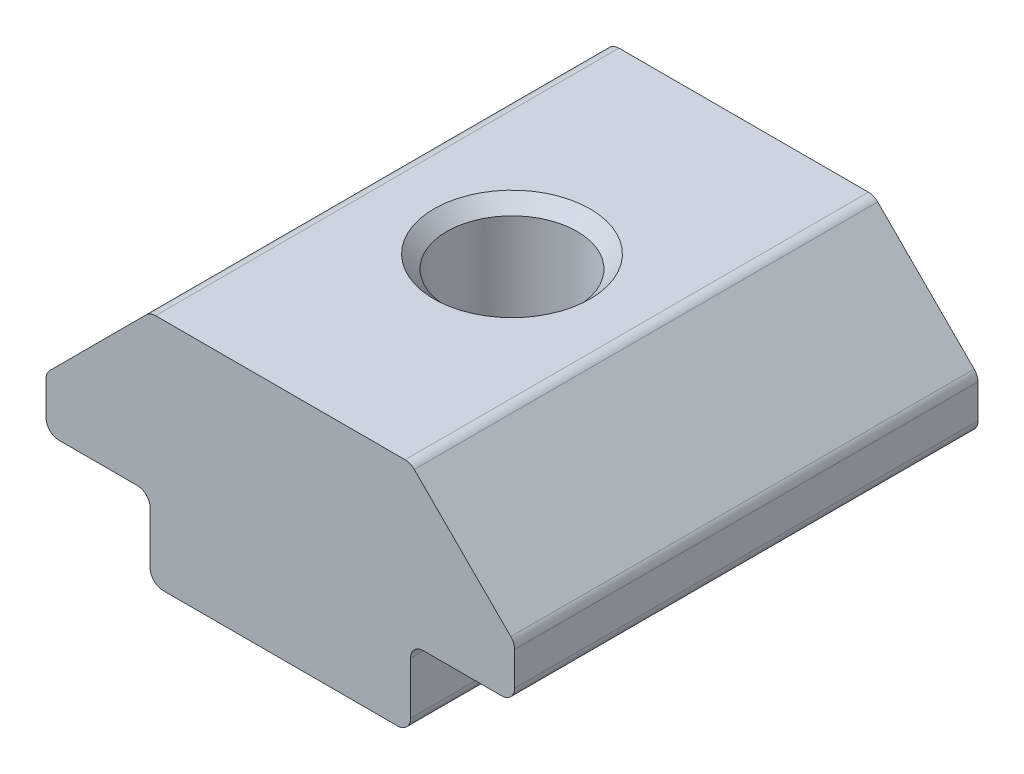
ISO-10303-21;
HEADER;
FILE_DESCRIPTION(('STEP AP214'),'2;1');
FILE_NAME('part.step','',(''),(''),'','','');
FILE_SCHEMA(('AUTOMOTIVE_DESIGN { 1 0 10303 214 1 1 1 1 }'));
ENDSEC;
DATA;
#1=APPLICATION_CONTEXT('core data for automotive mechanical design processes');
#2=APPLICATION_PROTOCOL_DEFINITION('international standard','automotive_design',2000,#1);
#3=PRODUCT_CONTEXT('',#1,'mechanical');
#4=PRODUCT('Part','Part','',(#3));
#5=PRODUCT_RELATED_PRODUCT_CATEGORY('part','',(#4));
#6=PRODUCT_DEFINITION_FORMATION('','',#4);
#7=PRODUCT_DEFINITION_CONTEXT('part definition',#1,'design');
#8=PRODUCT_DEFINITION('design','',#6,#7);
#9=PRODUCT_DEFINITION_SHAPE('','',#8);
#10=(LENGTH_UNIT() NAMED_UNIT(*) SI_UNIT(.MILLI.,.METRE.));
#11=(NAMED_UNIT(*) PLANE_ANGLE_UNIT() SI_UNIT($,.RADIAN.));
#12=(NAMED_UNIT(*) SI_UNIT($,.STERADIAN.) SOLID_ANGLE_UNIT());
#13=UNCERTAINTY_MEASURE_WITH_UNIT(LENGTH_MEASURE(1.E-05),#10,'distance_accuracy_value','');
#14=(GEOMETRIC_REPRESENTATION_CONTEXT(3) GLOBAL_UNCERTAINTY_ASSIGNED_CONTEXT((#13)) GLOBAL_UNIT_ASSIGNED_CONTEXT((#10,
#11,#12)) REPRESENTATION_CONTEXT('',''));
#15=CARTESIAN_POINT('',(0.,0.,0.));
#16=DIRECTION('',(0.,0.,1.));
#17=DIRECTION('',(1.,0.,0.));
#18=AXIS2_PLACEMENT_3D('',#15,#16,#17);
#19=CARTESIAN_POINT('',(-6.96668079058782,1.74958475249559,7.61762414375098));
#20=DIRECTION('',(1.,0.,0.));
#21=DIRECTION('',(0.,0.,-1.));
#22=AXIS2_PLACEMENT_3D('',#19,#20,#21);
#23=PLANE('',#22);
#24=DIRECTION('',(0.,-1.,0.));
#25=VECTOR('',#24,1.);
#26=CARTESIAN_POINT('',(-6.96668079058782,1.74958475249559,7.61762414375098));
#27=LINE('',#26,#25);
#28=CARTESIAN_POINT('',(-6.96668079058782,1.24958475249559,7.61762414375098));
#29=VERTEX_POINT('',#28);
#30=CARTESIAN_POINT('',(-6.96668079058782,-0.750415247504405,7.61762414375098));
#31=VERTEX_POINT('',#30);
#32=EDGE_CURVE('E204',#29,#31,#27,.T.);
#33=ORIENTED_EDGE('',*,*,#32,.F.);
#34=DIRECTION('',(0.,0.,-1.));
#35=VECTOR('',#34,1.);
#36=CARTESIAN_POINT('',(-6.96668079058782,1.24958475249559,-10.182375856249));
#37=LINE('',#36,#35);
#38=CARTESIAN_POINT('',(-6.96668079058782,1.24958475249559,-10.182375856249));
#39=VERTEX_POINT('',#38);
#40=EDGE_CURVE('E288',#29,#39,#37,.T.);
#41=ORIENTED_EDGE('',*,*,#40,.T.);
#42=DIRECTION('',(0.,-1.,0.));
#43=VECTOR('',#42,1.);
#44=CARTESIAN_POINT('',(-6.96668079058782,1.74958475249559,-10.182375856249));
#45=LINE('',#44,#43);
#46=CARTESIAN_POINT('',(-6.96668079058782,-0.750415247504405,-10.182375856249));
#47=VERTEX_POINT('',#46);
#48=EDGE_CURVE('E178',#39,#47,#45,.T.);
#49=ORIENTED_EDGE('',*,*,#48,.T.);
#50=DIRECTION('',(0.,0.,-1.));
#51=VECTOR('',#50,1.);
#52=CARTESIAN_POINT('',(-6.96668079058782,-0.750415247504405,7.61762414375098));
#53=LINE('',#52,#51);
#54=EDGE_CURVE('E160',#47,#31,#53,.F.);
#55=ORIENTED_EDGE('',*,*,#54,.T.);
#56=EDGE_LOOP('',(#33,#41,#49,#55));
#57=FACE_BOUND('',#56,.T.);
#58=ADVANCED_FACE('F16',(#57),#23,.F.);
#59=CARTESIAN_POINT('',(-6.96668079058782,-1.25041524750441,7.61762414375098));
#60=DIRECTION('',(0.,1.,0.));
#61=DIRECTION('',(0.,0.,1.));
#62=AXIS2_PLACEMENT_3D('',#59,#60,#61);
#63=PLANE('',#62);
#64=CARTESIAN_POINT('',(-1.96668079058781,-1.25041524750441,-1.28237585624902));
#65=DIRECTION('',(0.,1.,0.));
#66=DIRECTION('',(0.,0.,1.));
#67=AXIS2_PLACEMENT_3D('',#64,#65,#66);
#68=CIRCLE('',#67,3.);
#69=CARTESIAN_POINT('',(-1.96668079058781,-1.25041524750441,1.71762414375098));
#70=VERTEX_POINT('',#69);
#71=EDGE_CURVE('E271',#70,#70,#68,.T.);
#72=ORIENTED_EDGE('',*,*,#71,.T.);
#73=EDGE_LOOP('',(#72));
#74=FACE_BOUND('',#73,.T.);
#75=DIRECTION('',(1.,0.,0.));
#76=VECTOR('',#75,1.);
#77=CARTESIAN_POINT('',(-6.96668079058782,-1.25041524750441,7.61762414375098));
#78=LINE('',#77,#76);
#79=CARTESIAN_POINT('',(-6.46668079058782,-1.25041524750441,7.61762414375098));
#80=VERTEX_POINT('',#79);
#81=CARTESIAN_POINT('',(2.53331920941219,-1.25041524750441,7.61762414375098));
#82=VERTEX_POINT('',#81);
#83=EDGE_CURVE('E171',#80,#82,#78,.T.);
#84=ORIENTED_EDGE('',*,*,#83,.F.);
#85=DIRECTION('',(0.,0.,-1.));
#86=VECTOR('',#85,1.);
#87=CARTESIAN_POINT('',(-6.46668079058782,-1.25041524750441,7.61762414375098));
#88=LINE('',#87,#86);
#89=CARTESIAN_POINT('',(-6.46668079058782,-1.25041524750441,-10.182375856249));
#90=VERTEX_POINT('',#89);
#91=EDGE_CURVE('E158',#80,#90,#88,.T.);
#92=ORIENTED_EDGE('',*,*,#91,.T.);
#93=DIRECTION('',(1.,0.,0.));
#94=VECTOR('',#93,1.);
#95=CARTESIAN_POINT('',(-6.96668079058782,-1.25041524750441,-10.182375856249));
#96=LINE('',#95,#94);
#97=CARTESIAN_POINT('',(2.53331920941219,-1.25041524750441,-10.182375856249));
#98=VERTEX_POINT('',#97);
#99=EDGE_CURVE('E168',#90,#98,#96,.T.);
#100=ORIENTED_EDGE('',*,*,#99,.T.);
#101=DIRECTION('',(0.,0.,-1.));
#102=VECTOR('',#101,1.);
#103=CARTESIAN_POINT('',(2.53331920941219,-1.25041524750441,7.61762414375098));
#104=LINE('',#103,#102);
#105=EDGE_CURVE('E173',#98,#82,#104,.F.);
#106=ORIENTED_EDGE('',*,*,#105,.T.);
#107=EDGE_LOOP('',(#84,#92,#100,#106));
#108=FACE_BOUND('',#107,.T.);
#109=ADVANCED_FACE('F167',(#74,#108),#63,.F.);
#110=CARTESIAN_POINT('',(3.03331920941218,-1.25041524750441,7.61762414375098));
#111=DIRECTION('',(-1.,0.,0.));
#112=DIRECTION('',(0.,0.,1.));
#113=AXIS2_PLACEMENT_3D('',#110,#111,#112);
#114=PLANE('',#113);
#115=DIRECTION('',(0.,1.,0.));
#116=VECTOR('',#115,1.);
#117=CARTESIAN_POINT('',(3.03331920941218,-1.25041524750441,-10.182375856249));
#118=LINE('',#117,#116);
#119=CARTESIAN_POINT('',(3.03331920941218,-0.750415247504405,-10.182375856249));
#120=VERTEX_POINT('',#119);
#121=CARTESIAN_POINT('',(3.03331920941218,1.24958475249559,-10.182375856249));
#122=VERTEX_POINT('',#121);
#123=EDGE_CURVE('E177',#120,#122,#118,.T.);
#124=ORIENTED_EDGE('',*,*,#123,.T.);
#125=DIRECTION('',(0.,0.,-1.));
#126=VECTOR('',#125,1.);
#127=CARTESIAN_POINT('',(3.03331920941218,1.24958475249559,7.61762414375098));
#128=LINE('',#127,#126);
#129=CARTESIAN_POINT('',(3.03331920941218,1.24958475249559,7.61762414375098));
#130=VERTEX_POINT('',#129);
#131=EDGE_CURVE('E286',#122,#130,#128,.F.);
#132=ORIENTED_EDGE('',*,*,#131,.T.);
#133=DIRECTION('',(0.,1.,0.));
#134=VECTOR('',#133,1.);
#135=CARTESIAN_POINT('',(3.03331920941218,-1.25041524750441,7.61762414375098));
#136=LINE('',#135,#134);
#137=CARTESIAN_POINT('',(3.03331920941218,-0.750415247504405,7.61762414375098));
#138=VERTEX_POINT('',#137);
#139=EDGE_CURVE('E302',#138,#130,#136,.T.);
#140=ORIENTED_EDGE('',*,*,#139,.F.);
#141=DIRECTION('',(0.,0.,-1.));
#142=VECTOR('',#141,1.);
#143=CARTESIAN_POINT('',(3.03331920941218,-0.750415247504405,7.61762414375098));
#144=LINE('',#143,#142);
#145=EDGE_CURVE('E268',#138,#120,#144,.T.);
#146=ORIENTED_EDGE('',*,*,#145,.T.);
#147=EDGE_LOOP('',(#124,#132,#140,#146));
#148=FACE_BOUND('',#147,.T.);
#149=ADVANCED_FACE('F315',(#148),#114,.F.);
#150=CARTESIAN_POINT('',(3.03331920941218,1.74958475249559,7.61762414375098));
#151=DIRECTION('',(0.,1.,0.));
#152=DIRECTION('',(0.,0.,1.));
#153=AXIS2_PLACEMENT_3D('',#150,#151,#152);
#154=PLANE('',#153);
#155=DIRECTION('',(1.,0.,0.));
#156=VECTOR('',#155,1.);
#157=CARTESIAN_POINT('',(3.03331920941218,1.74958475249559,7.61762414375098));
#158=LINE('',#157,#156);
#159=CARTESIAN_POINT('',(3.53331920941218,1.74958475249559,7.61762414375098));
#160=VERTEX_POINT('',#159);
#161=CARTESIAN_POINT('',(6.53331920941218,1.74958475249559,7.61762414375098));
#162=VERTEX_POINT('',#161);
#163=EDGE_CURVE('E300',#160,#162,#158,.T.);
#164=ORIENTED_EDGE('',*,*,#163,.F.);
#165=DIRECTION('',(0.,0.,-1.));
#166=VECTOR('',#165,1.);
#167=CARTESIAN_POINT('',(3.53331920941218,1.74958475249559,-10.182375856249));
#168=LINE('',#167,#166);
#169=CARTESIAN_POINT('',(3.53331920941218,1.74958475249559,-10.182375856249));
#170=VERTEX_POINT('',#169);
#171=EDGE_CURVE('E283',#160,#170,#168,.T.);
#172=ORIENTED_EDGE('',*,*,#171,.T.);
#173=DIRECTION('',(1.,0.,0.));
#174=VECTOR('',#173,1.);
#175=CARTESIAN_POINT('',(3.03331920941218,1.74958475249559,-10.182375856249));
#176=LINE('',#175,#174);
#177=CARTESIAN_POINT('',(6.53331920941218,1.74958475249559,-10.182375856249));
#178=VERTEX_POINT('',#177);
#179=EDGE_CURVE('E181',#170,#178,#176,.T.);
#180=ORIENTED_EDGE('',*,*,#179,.T.);
#181=DIRECTION('',(0.,0.,-1.));
#182=VECTOR('',#181,1.);
#183=CARTESIAN_POINT('',(6.53331920941218,1.74958475249559,7.61762414375098));
#184=LINE('',#183,#182);
#185=EDGE_CURVE('E265',#178,#162,#184,.F.);
#186=ORIENTED_EDGE('',*,*,#185,.T.);
#187=EDGE_LOOP('',(#164,#172,#180,#186));
#188=FACE_BOUND('',#187,.T.);
#189=ADVANCED_FACE('F307',(#188),#154,.F.);
#190=CARTESIAN_POINT('',(7.03331920941218,1.74958475249559,7.61762414375098));
#191=DIRECTION('',(-1.,0.,0.));
#192=DIRECTION('',(0.,0.,1.));
#193=AXIS2_PLACEMENT_3D('',#190,#191,#192);
#194=PLANE('',#193);
#195=DIRECTION('',(0.,1.,0.));
#196=VECTOR('',#195,1.);
#197=CARTESIAN_POINT('',(7.03331920941218,1.74958475249559,-10.182375856249));
#198=LINE('',#197,#196);
#199=CARTESIAN_POINT('',(7.03331920941218,2.24958475249559,-10.182375856249));
#200=VERTEX_POINT('',#199);
#201=CARTESIAN_POINT('',(7.03331920941218,3.54247797130906,-10.182375856249));
#202=VERTEX_POINT('',#201);
#203=EDGE_CURVE('E187',#200,#202,#198,.T.);
#204=ORIENTED_EDGE('',*,*,#203,.T.);
#205=DIRECTION('',(0.,0.,-1.));
#206=VECTOR('',#205,1.);
#207=CARTESIAN_POINT('',(7.03331920941218,3.54247797130906,7.61762414375098));
#208=LINE('',#207,#206);
#209=CARTESIAN_POINT('',(7.03331920941218,3.54247797130906,7.61762414375098));
#210=VERTEX_POINT('',#209);
#211=EDGE_CURVE('E263',#202,#210,#208,.F.);
#212=ORIENTED_EDGE('',*,*,#211,.T.);
#213=DIRECTION('',(0.,1.,0.));
#214=VECTOR('',#213,1.);
#215=CARTESIAN_POINT('',(7.03331920941218,1.74958475249559,7.61762414375098));
#216=LINE('',#215,#214);
#217=CARTESIAN_POINT('',(7.03331920941218,2.24958475249559,7.61762414375098));
#218=VERTEX_POINT('',#217);
#219=EDGE_CURVE('E311',#218,#210,#216,.T.);
#220=ORIENTED_EDGE('',*,*,#219,.F.);
#221=DIRECTION('',(0.,0.,-1.));
#222=VECTOR('',#221,1.);
#223=CARTESIAN_POINT('',(7.03331920941218,2.24958475249559,7.61762414375098));
#224=LINE('',#223,#222);
#225=EDGE_CURVE('E260',#218,#200,#224,.T.);
#226=ORIENTED_EDGE('',*,*,#225,.T.);
#227=EDGE_LOOP('',(#204,#212,#220,#226));
#228=FACE_BOUND('',#227,.T.);
#229=ADVANCED_FACE('F541',(#228),#194,.F.);
#230=CARTESIAN_POINT('',(7.03331920941218,3.74958475249561,7.61762414375098));
#231=DIRECTION('',(-0.707106781186546,-0.707106781186549,0.));
#232=DIRECTION('',(0.707106781186549,-0.707106781186546,0.));
#233=AXIS2_PLACEMENT_3D('',#230,#231,#232);
#234=PLANE('',#233);
#235=DIRECTION('',(-0.707106781186549,0.707106781186546,0.));
#236=VECTOR('',#235,1.);
#237=CARTESIAN_POINT('',(7.03331920941218,3.74958475249561,-10.182375856249));
#238=LINE('',#237,#236);
#239=CARTESIAN_POINT('',(6.88687260000546,3.89603136190234,-10.182375856249));
#240=VERTEX_POINT('',#239);
#241=CARTESIAN_POINT('',(3.17976581881891,7.60313814308887,-10.182375856249));
#242=VERTEX_POINT('',#241);
#243=EDGE_CURVE('E190',#240,#242,#238,.T.);
#244=ORIENTED_EDGE('',*,*,#243,.T.);
#245=DIRECTION('',(0.,0.,-1.));
#246=VECTOR('',#245,1.);
#247=CARTESIAN_POINT('',(3.17976581881891,7.60313814308887,7.61762414375098));
#248=LINE('',#247,#246);
#249=CARTESIAN_POINT('',(3.17976581881891,7.60313814308887,7.61762414375098));
#250=VERTEX_POINT('',#249);
#251=EDGE_CURVE('E258',#242,#250,#248,.F.);
#252=ORIENTED_EDGE('',*,*,#251,.T.);
#253=DIRECTION('',(-0.707106781186549,0.707106781186546,0.));
#254=VECTOR('',#253,1.);
#255=CARTESIAN_POINT('',(7.03331920941218,3.74958475249561,7.61762414375098));
#256=LINE('',#255,#254);
#257=CARTESIAN_POINT('',(6.88687260000546,3.89603136190234,7.61762414375098));
#258=VERTEX_POINT('',#257);
#259=EDGE_CURVE('E326',#258,#250,#256,.T.);
#260=ORIENTED_EDGE('',*,*,#259,.F.);
#261=DIRECTION('',(0.,0.,-1.));
#262=VECTOR('',#261,1.);
#263=CARTESIAN_POINT('',(6.88687260000546,3.89603136190234,7.61762414375098));
#264=LINE('',#263,#262);
#265=EDGE_CURVE('E255',#258,#240,#264,.T.);
#266=ORIENTED_EDGE('',*,*,#265,.T.);
#267=EDGE_LOOP('',(#244,#252,#260,#266));
#268=FACE_BOUND('',#267,.T.);
#269=ADVANCED_FACE('F531',(#268),#234,.F.);
#270=CARTESIAN_POINT('',(3.03331920941218,7.74958475249559,7.61762414375098));
#271=DIRECTION('',(0.,-1.,0.));
#272=DIRECTION('',(0.,0.,-1.));
#273=AXIS2_PLACEMENT_3D('',#270,#271,#272);
#274=PLANE('',#273);
#275=CARTESIAN_POINT('',(-1.96668079058781,7.74958475249559,-1.28237585624902));
#276=DIRECTION('',(0.,-1.,0.));
#277=DIRECTION('',(0.,0.,-1.));
#278=AXIS2_PLACEMENT_3D('',#275,#276,#277);
#279=CIRCLE('',#278,3.00000000000001);
#280=CARTESIAN_POINT('',(-1.96668079058781,7.74958475249559,-4.28237585624902));
#281=VERTEX_POINT('',#280);
#282=EDGE_CURVE('E280',#281,#281,#279,.T.);
#283=ORIENTED_EDGE('',*,*,#282,.T.);
#284=EDGE_LOOP('',(#283));
#285=FACE_BOUND('',#284,.T.);
#286=DIRECTION('',(-1.,0.,0.));
#287=VECTOR('',#286,1.);
#288=CARTESIAN_POINT('',(3.03331920941218,7.74958475249559,-10.182375856249));
#289=LINE('',#288,#287);
#290=CARTESIAN_POINT('',(2.82621242822564,7.74958475249559,-10.182375856249));
#291=VERTEX_POINT('',#290);
#292=CARTESIAN_POINT('',(-6.75957400940127,7.74958475249559,-10.182375856249));
#293=VERTEX_POINT('',#292);
#294=EDGE_CURVE('E193',#291,#293,#289,.T.);
#295=ORIENTED_EDGE('',*,*,#294,.T.);
#296=DIRECTION('',(0.,0.,-1.));
#297=VECTOR('',#296,1.);
#298=CARTESIAN_POINT('',(-6.75957400940127,7.74958475249559,7.61762414375098));
#299=LINE('',#298,#297);
#300=CARTESIAN_POINT('',(-6.75957400940127,7.74958475249559,7.61762414375098));
#301=VERTEX_POINT('',#300);
#302=EDGE_CURVE('E253',#293,#301,#299,.F.);
#303=ORIENTED_EDGE('',*,*,#302,.T.);
#304=DIRECTION('',(-1.,0.,0.));
#305=VECTOR('',#304,1.);
#306=CARTESIAN_POINT('',(3.03331920941218,7.74958475249559,7.61762414375098));
#307=LINE('',#306,#305);
#308=CARTESIAN_POINT('',(2.82621242822564,7.74958475249559,7.61762414375098));
#309=VERTEX_POINT('',#308);
#310=EDGE_CURVE('E329',#309,#301,#307,.T.);
#311=ORIENTED_EDGE('',*,*,#310,.F.);
#312=DIRECTION('',(0.,0.,-1.));
#313=VECTOR('',#312,1.);
#314=CARTESIAN_POINT('',(2.82621242822564,7.74958475249559,7.61762414375098));
#315=LINE('',#314,#313);
#316=EDGE_CURVE('E250',#309,#291,#315,.T.);
#317=ORIENTED_EDGE('',*,*,#316,.T.);
#318=EDGE_LOOP('',(#295,#303,#311,#317));
#319=FACE_BOUND('',#318,.T.);
#320=ADVANCED_FACE('F521',(#285,#319),#274,.F.);
#321=CARTESIAN_POINT('',(-10.9666807905878,3.74958475249561,7.61762414375098));
#322=DIRECTION('',(0.707106781186546,-0.707106781186549,0.));
#323=DIRECTION('',(0.707106781186549,0.707106781186546,0.));
#324=AXIS2_PLACEMENT_3D('',#321,#322,#323);
#325=PLANE('',#324);
#326=DIRECTION('',(-0.707106781186549,-0.707106781186546,0.));
#327=VECTOR('',#326,1.);
#328=CARTESIAN_POINT('',(-10.9666807905878,3.74958475249561,-10.182375856249));
#329=LINE('',#328,#327);
#330=CARTESIAN_POINT('',(-7.11312739999454,7.60313814308887,-10.182375856249));
#331=VERTEX_POINT('',#330);
#332=CARTESIAN_POINT('',(-10.8202341811811,3.89603136190233,-10.182375856249));
#333=VERTEX_POINT('',#332);
#334=EDGE_CURVE('E196',#331,#333,#329,.T.);
#335=ORIENTED_EDGE('',*,*,#334,.T.);
#336=DIRECTION('',(0.,0.,-1.));
#337=VECTOR('',#336,1.);
#338=CARTESIAN_POINT('',(-10.8202341811811,3.89603136190233,7.61762414375098));
#339=LINE('',#338,#337);
#340=CARTESIAN_POINT('',(-10.8202341811811,3.89603136190233,7.61762414375098));
#341=VERTEX_POINT('',#340);
#342=EDGE_CURVE('E248',#333,#341,#339,.F.);
#343=ORIENTED_EDGE('',*,*,#342,.T.);
#344=DIRECTION('',(-0.707106781186549,-0.707106781186546,0.));
#345=VECTOR('',#344,1.);
#346=CARTESIAN_POINT('',(-10.9666807905878,3.74958475249561,7.61762414375098));
#347=LINE('',#346,#345);
#348=CARTESIAN_POINT('',(-7.11312739999454,7.60313814308887,7.61762414375098));
#349=VERTEX_POINT('',#348);
#350=EDGE_CURVE('E332',#349,#341,#347,.T.);
#351=ORIENTED_EDGE('',*,*,#350,.F.);
#352=DIRECTION('',(0.,0.,-1.));
#353=VECTOR('',#352,1.);
#354=CARTESIAN_POINT('',(-7.11312739999454,7.60313814308887,7.61762414375098));
#355=LINE('',#354,#353);
#356=EDGE_CURVE('E245',#349,#331,#355,.T.);
#357=ORIENTED_EDGE('',*,*,#356,.T.);
#358=EDGE_LOOP('',(#335,#343,#351,#357));
#359=FACE_BOUND('',#358,.T.);
#360=ADVANCED_FACE('F511',(#359),#325,.F.);
#361=CARTESIAN_POINT('',(-10.9666807905878,1.74958475249559,7.61762414375098));
#362=DIRECTION('',(1.,0.,0.));
#363=DIRECTION('',(0.,0.,-1.));
#364=AXIS2_PLACEMENT_3D('',#361,#362,#363);
#365=PLANE('',#364);
#366=DIRECTION('',(0.,-1.,0.));
#367=VECTOR('',#366,1.);
#368=CARTESIAN_POINT('',(-10.9666807905878,1.74958475249559,-10.182375856249));
#369=LINE('',#368,#367);
#370=CARTESIAN_POINT('',(-10.9666807905878,3.54247797130906,-10.182375856249));
#371=VERTEX_POINT('',#370);
#372=CARTESIAN_POINT('',(-10.9666807905878,2.24958475249559,-10.182375856249));
#373=VERTEX_POINT('',#372);
#374=EDGE_CURVE('E199',#371,#373,#369,.T.);
#375=ORIENTED_EDGE('',*,*,#374,.T.);
#376=DIRECTION('',(0.,0.,-1.));
#377=VECTOR('',#376,1.);
#378=CARTESIAN_POINT('',(-10.9666807905878,2.24958475249559,7.61762414375098));
#379=LINE('',#378,#377);
#380=CARTESIAN_POINT('',(-10.9666807905878,2.24958475249559,7.61762414375098));
#381=VERTEX_POINT('',#380);
#382=EDGE_CURVE('E243',#373,#381,#379,.F.);
#383=ORIENTED_EDGE('',*,*,#382,.T.);
#384=DIRECTION('',(0.,-1.,0.));
#385=VECTOR('',#384,1.);
#386=CARTESIAN_POINT('',(-10.9666807905878,1.74958475249559,7.61762414375098));
#387=LINE('',#386,#385);
#388=CARTESIAN_POINT('',(-10.9666807905878,3.54247797130906,7.61762414375098));
#389=VERTEX_POINT('',#388);
#390=EDGE_CURVE('E335',#389,#381,#387,.T.);
#391=ORIENTED_EDGE('',*,*,#390,.F.);
#392=DIRECTION('',(0.,0.,-1.));
#393=VECTOR('',#392,1.);
#394=CARTESIAN_POINT('',(-10.9666807905878,3.54247797130906,7.61762414375098));
#395=LINE('',#394,#393);
#396=EDGE_CURVE('E240',#389,#371,#395,.T.);
#397=ORIENTED_EDGE('',*,*,#396,.T.);
#398=EDGE_LOOP('',(#375,#383,#391,#397));
#399=FACE_BOUND('',#398,.T.);
#400=ADVANCED_FACE('F502',(#399),#365,.F.);
#401=CARTESIAN_POINT('',(-10.9666807905878,1.74958475249559,7.61762414375098));
#402=DIRECTION('',(0.,1.,0.));
#403=DIRECTION('',(0.,0.,1.));
#404=AXIS2_PLACEMENT_3D('',#401,#402,#403);
#405=PLANE('',#404);
#406=DIRECTION('',(1.,0.,0.));
#407=VECTOR('',#406,1.);
#408=CARTESIAN_POINT('',(-10.9666807905878,1.74958475249559,-10.182375856249));
#409=LINE('',#408,#407);
#410=CARTESIAN_POINT('',(-10.4666807905878,1.74958475249559,-10.182375856249));
#411=VERTEX_POINT('',#410);
#412=CARTESIAN_POINT('',(-7.46668079058782,1.74958475249559,-10.182375856249));
#413=VERTEX_POINT('',#412);
#414=EDGE_CURVE('E202',#411,#413,#409,.T.);
#415=ORIENTED_EDGE('',*,*,#414,.T.);
#416=DIRECTION('',(0.,0.,-1.));
#417=VECTOR('',#416,1.);
#418=CARTESIAN_POINT('',(-7.46668079058782,1.74958475249559,7.61762414375098));
#419=LINE('',#418,#417);
#420=CARTESIAN_POINT('',(-7.46668079058782,1.74958475249559,7.61762414375098));
#421=VERTEX_POINT('',#420);
#422=EDGE_CURVE('E37',#413,#421,#419,.F.);
#423=ORIENTED_EDGE('',*,*,#422,.T.);
#424=DIRECTION('',(1.,0.,0.));
#425=VECTOR('',#424,1.);
#426=CARTESIAN_POINT('',(-10.9666807905878,1.74958475249559,7.61762414375098));
#427=LINE('',#426,#425);
#428=CARTESIAN_POINT('',(-10.4666807905878,1.74958475249559,7.61762414375098));
#429=VERTEX_POINT('',#428);
#430=EDGE_CURVE('E205',#429,#421,#427,.T.);
#431=ORIENTED_EDGE('',*,*,#430,.F.);
#432=DIRECTION('',(0.,0.,-1.));
#433=VECTOR('',#432,1.);
#434=CARTESIAN_POINT('',(-10.4666807905878,1.74958475249559,7.61762414375098));
#435=LINE('',#434,#433);
#436=EDGE_CURVE('E237',#429,#411,#435,.T.);
#437=ORIENTED_EDGE('',*,*,#436,.T.);
#438=EDGE_LOOP('',(#415,#423,#431,#437));
#439=FACE_BOUND('',#438,.T.);
#440=ADVANCED_FACE('F493',(#439),#405,.F.);
#441=CARTESIAN_POINT('',(-1.96668079058782,-1.25041524750441,7.61762414375098));
#442=DIRECTION('',(0.,0.,1.));
#443=DIRECTION('',(1.,0.,0.));
#444=AXIS2_PLACEMENT_3D('',#441,#442,#443);
#445=PLANE('',#444);
#446=ORIENTED_EDGE('',*,*,#430,.T.);
#447=CARTESIAN_POINT('',(-7.46668079058782,1.24958475249559,7.61762414375098));
#448=DIRECTION('',(0.,0.,1.));
#449=DIRECTION('',(1.,0.,0.));
#450=AXIS2_PLACEMENT_3D('',#447,#448,#449);
#451=CIRCLE('',#450,0.5);
#452=EDGE_CURVE('E10',#421,#29,#451,.F.);
#453=ORIENTED_EDGE('',*,*,#452,.T.);
#454=ORIENTED_EDGE('',*,*,#32,.T.);
#455=CARTESIAN_POINT('',(-6.46668079058782,-0.750415247504405,7.61762414375098));
#456=DIRECTION('',(0.,0.,1.));
#457=DIRECTION('',(1.,0.,0.));
#458=AXIS2_PLACEMENT_3D('',#455,#456,#457);
#459=CIRCLE('',#458,0.5);
#460=EDGE_CURVE('E235',#31,#80,#459,.T.);
#461=ORIENTED_EDGE('',*,*,#460,.T.);
#462=ORIENTED_EDGE('',*,*,#83,.T.);
#463=CARTESIAN_POINT('',(2.53331920941218,-0.750415247504405,7.61762414375098));
#464=DIRECTION('',(0.,0.,1.));
#465=DIRECTION('',(1.,0.,0.));
#466=AXIS2_PLACEMENT_3D('',#463,#464,#465);
#467=CIRCLE('',#466,0.5);
#468=EDGE_CURVE('E221',#82,#138,#467,.T.);
#469=ORIENTED_EDGE('',*,*,#468,.T.);
#470=ORIENTED_EDGE('',*,*,#139,.T.);
#471=CARTESIAN_POINT('',(3.53331920941218,1.24958475249559,7.61762414375098));
#472=DIRECTION('',(0.,0.,1.));
#473=DIRECTION('',(1.,0.,0.));
#474=AXIS2_PLACEMENT_3D('',#471,#472,#473);
#475=CIRCLE('',#474,0.5);
#476=EDGE_CURVE('E294',#130,#160,#475,.F.);
#477=ORIENTED_EDGE('',*,*,#476,.T.);
#478=ORIENTED_EDGE('',*,*,#163,.T.);
#479=CARTESIAN_POINT('',(6.53331920941218,2.24958475249559,7.61762414375098));
#480=DIRECTION('',(0.,0.,1.));
#481=DIRECTION('',(1.,0.,0.));
#482=AXIS2_PLACEMENT_3D('',#479,#480,#481);
#483=CIRCLE('',#482,0.5);
#484=EDGE_CURVE('E223',#162,#218,#483,.T.);
#485=ORIENTED_EDGE('',*,*,#484,.T.);
#486=ORIENTED_EDGE('',*,*,#219,.T.);
#487=CARTESIAN_POINT('',(6.53331920941218,3.54247797130906,7.61762414375098));
#488=DIRECTION('',(0.,0.,1.));
#489=DIRECTION('',(1.,0.,0.));
#490=AXIS2_PLACEMENT_3D('',#487,#488,#489);
#491=CIRCLE('',#490,0.5);
#492=EDGE_CURVE('E225',#210,#258,#491,.T.);
#493=ORIENTED_EDGE('',*,*,#492,.T.);
#494=ORIENTED_EDGE('',*,*,#259,.T.);
#495=CARTESIAN_POINT('',(2.82621242822564,7.24958475249559,7.61762414375098));
#496=DIRECTION('',(0.,0.,1.));
#497=DIRECTION('',(1.,0.,0.));
#498=AXIS2_PLACEMENT_3D('',#495,#496,#497);
#499=CIRCLE('',#498,0.5);
#500=EDGE_CURVE('E227',#250,#309,#499,.T.);
#501=ORIENTED_EDGE('',*,*,#500,.T.);
#502=ORIENTED_EDGE('',*,*,#310,.T.);
#503=CARTESIAN_POINT('',(-6.75957400940127,7.24958475249559,7.61762414375098));
#504=DIRECTION('',(0.,0.,1.));
#505=DIRECTION('',(1.,0.,0.));
#506=AXIS2_PLACEMENT_3D('',#503,#504,#505);
#507=CIRCLE('',#506,0.5);
#508=EDGE_CURVE('E229',#301,#349,#507,.T.);
#509=ORIENTED_EDGE('',*,*,#508,.T.);
#510=ORIENTED_EDGE('',*,*,#350,.T.);
#511=CARTESIAN_POINT('',(-10.4666807905878,3.54247797130906,7.61762414375098));
#512=DIRECTION('',(0.,0.,1.));
#513=DIRECTION('',(1.,0.,0.));
#514=AXIS2_PLACEMENT_3D('',#511,#512,#513);
#515=CIRCLE('',#514,0.5);
#516=EDGE_CURVE('E231',#341,#389,#515,.T.);
#517=ORIENTED_EDGE('',*,*,#516,.T.);
#518=ORIENTED_EDGE('',*,*,#390,.T.);
#519=CARTESIAN_POINT('',(-10.4666807905878,2.24958475249559,7.61762414375098));
#520=DIRECTION('',(0.,0.,1.));
#521=DIRECTION('',(1.,0.,0.));
#522=AXIS2_PLACEMENT_3D('',#519,#520,#521);
#523=CIRCLE('',#522,0.5);
#524=EDGE_CURVE('E233',#381,#429,#523,.T.);
#525=ORIENTED_EDGE('',*,*,#524,.T.);
#526=EDGE_LOOP('',(#446,#453,#454,#461,#462,#469,#470,#477,#478,#485,#486,#493,#494,#501,#502,
#509,#510,#517,#518,#525));
#527=FACE_BOUND('',#526,.T.);
#528=ADVANCED_FACE('F299',(#527),#445,.T.);
#529=CARTESIAN_POINT('',(-1.96668079058782,-1.25041524750441,-10.182375856249));
#530=DIRECTION('',(0.,0.,1.));
#531=DIRECTION('',(1.,0.,0.));
#532=AXIS2_PLACEMENT_3D('',#529,#530,#531);
#533=PLANE('',#532);
#534=ORIENTED_EDGE('',*,*,#99,.F.);
#535=CARTESIAN_POINT('',(-6.46668079058782,-0.750415247504405,-10.182375856249));
#536=DIRECTION('',(0.,0.,1.));
#537=DIRECTION('',(1.,0.,0.));
#538=AXIS2_PLACEMENT_3D('',#535,#536,#537);
#539=CIRCLE('',#538,0.5);
#540=EDGE_CURVE('E154',#90,#47,#539,.F.);
#541=ORIENTED_EDGE('',*,*,#540,.T.);
#542=ORIENTED_EDGE('',*,*,#48,.F.);
#543=CARTESIAN_POINT('',(-7.46668079058782,1.24958475249559,-10.182375856249));
#544=DIRECTION('',(0.,0.,1.));
#545=DIRECTION('',(1.,0.,0.));
#546=AXIS2_PLACEMENT_3D('',#543,#544,#545);
#547=CIRCLE('',#546,0.5);
#548=EDGE_CURVE('E24',#39,#413,#547,.T.);
#549=ORIENTED_EDGE('',*,*,#548,.T.);
#550=ORIENTED_EDGE('',*,*,#414,.F.);
#551=CARTESIAN_POINT('',(-10.4666807905878,2.24958475249559,-10.182375856249));
#552=DIRECTION('',(0.,0.,1.));
#553=DIRECTION('',(1.,0.,0.));
#554=AXIS2_PLACEMENT_3D('',#551,#552,#553);
#555=CIRCLE('',#554,0.5);
#556=EDGE_CURVE('E162',#411,#373,#555,.F.);
#557=ORIENTED_EDGE('',*,*,#556,.T.);
#558=ORIENTED_EDGE('',*,*,#374,.F.);
#559=CARTESIAN_POINT('',(-10.4666807905878,3.54247797130906,-10.182375856249));
#560=DIRECTION('',(0.,0.,1.));
#561=DIRECTION('',(1.,0.,0.));
#562=AXIS2_PLACEMENT_3D('',#559,#560,#561);
#563=CIRCLE('',#562,0.5);
#564=EDGE_CURVE('E217',#371,#333,#563,.F.);
#565=ORIENTED_EDGE('',*,*,#564,.T.);
#566=ORIENTED_EDGE('',*,*,#334,.F.);
#567=CARTESIAN_POINT('',(-6.75957400940127,7.24958475249559,-10.182375856249));
#568=DIRECTION('',(0.,0.,1.));
#569=DIRECTION('',(1.,0.,0.));
#570=AXIS2_PLACEMENT_3D('',#567,#568,#569);
#571=CIRCLE('',#570,0.5);
#572=EDGE_CURVE('E215',#331,#293,#571,.F.);
#573=ORIENTED_EDGE('',*,*,#572,.T.);
#574=ORIENTED_EDGE('',*,*,#294,.F.);
#575=CARTESIAN_POINT('',(2.82621242822564,7.24958475249559,-10.182375856249));
#576=DIRECTION('',(0.,0.,1.));
#577=DIRECTION('',(1.,0.,0.));
#578=AXIS2_PLACEMENT_3D('',#575,#576,#577);
#579=CIRCLE('',#578,0.5);
#580=EDGE_CURVE('E213',#291,#242,#579,.F.);
#581=ORIENTED_EDGE('',*,*,#580,.T.);
#582=ORIENTED_EDGE('',*,*,#243,.F.);
#583=CARTESIAN_POINT('',(6.53331920941218,3.54247797130906,-10.182375856249));
#584=DIRECTION('',(0.,0.,1.));
#585=DIRECTION('',(1.,0.,0.));
#586=AXIS2_PLACEMENT_3D('',#583,#584,#585);
#587=CIRCLE('',#586,0.5);
#588=EDGE_CURVE('E211',#240,#202,#587,.F.);
#589=ORIENTED_EDGE('',*,*,#588,.T.);
#590=ORIENTED_EDGE('',*,*,#203,.F.);
#591=CARTESIAN_POINT('',(6.53331920941218,2.24958475249559,-10.182375856249));
#592=DIRECTION('',(0.,0.,1.));
#593=DIRECTION('',(1.,0.,0.));
#594=AXIS2_PLACEMENT_3D('',#591,#592,#593);
#595=CIRCLE('',#594,0.5);
#596=EDGE_CURVE('E208',#200,#178,#595,.F.);
#597=ORIENTED_EDGE('',*,*,#596,.T.);
#598=ORIENTED_EDGE('',*,*,#179,.F.);
#599=CARTESIAN_POINT('',(3.53331920941218,1.24958475249559,-10.182375856249));
#600=DIRECTION('',(0.,0.,1.));
#601=DIRECTION('',(1.,0.,0.));
#602=AXIS2_PLACEMENT_3D('',#599,#600,#601);
#603=CIRCLE('',#602,0.5);
#604=EDGE_CURVE('E292',#170,#122,#603,.T.);
#605=ORIENTED_EDGE('',*,*,#604,.T.);
#606=ORIENTED_EDGE('',*,*,#123,.F.);
#607=CARTESIAN_POINT('',(2.53331920941218,-0.750415247504405,-10.182375856249));
#608=DIRECTION('',(0.,0.,1.));
#609=DIRECTION('',(1.,0.,0.));
#610=AXIS2_PLACEMENT_3D('',#607,#608,#609);
#611=CIRCLE('',#610,0.5);
#612=EDGE_CURVE('E172',#120,#98,#611,.F.);
#613=ORIENTED_EDGE('',*,*,#612,.T.);
#614=EDGE_LOOP('',(#534,#541,#542,#549,#550,#557,#558,#565,#566,#573,#574,#581,#582,#589,#590,
#597,#598,#605,#606,#613));
#615=FACE_BOUND('',#614,.T.);
#616=ADVANCED_FACE('F175',(#615),#533,.F.);
#617=CARTESIAN_POINT('',(-6.46668079058782,-0.750415247504405,7.61762414375098));
#618=DIRECTION('',(0.,0.,-1.));
#619=DIRECTION('',(-1.,0.,0.));
#620=AXIS2_PLACEMENT_3D('',#617,#618,#619);
#621=CYLINDRICAL_SURFACE('',#620,0.5);
#622=ORIENTED_EDGE('',*,*,#460,.F.);
#623=ORIENTED_EDGE('',*,*,#54,.F.);
#624=ORIENTED_EDGE('',*,*,#540,.F.);
#625=ORIENTED_EDGE('',*,*,#91,.F.);
#626=EDGE_LOOP('',(#622,#623,#624,#625));
#627=FACE_BOUND('',#626,.T.);
#628=ADVANCED_FACE('F157',(#627),#621,.T.);
#629=CARTESIAN_POINT('',(-10.4666807905878,2.24958475249559,7.61762414375098));
#630=DIRECTION('',(0.,0.,-1.));
#631=DIRECTION('',(-1.,0.,0.));
#632=AXIS2_PLACEMENT_3D('',#629,#630,#631);
#633=CYLINDRICAL_SURFACE('',#632,0.5);
#634=ORIENTED_EDGE('',*,*,#524,.F.);
#635=ORIENTED_EDGE('',*,*,#382,.F.);
#636=ORIENTED_EDGE('',*,*,#556,.F.);
#637=ORIENTED_EDGE('',*,*,#436,.F.);
#638=EDGE_LOOP('',(#634,#635,#636,#637));
#639=FACE_BOUND('',#638,.T.);
#640=ADVANCED_FACE('F356',(#639),#633,.T.);
#641=CARTESIAN_POINT('',(-10.4666807905878,3.54247797130906,7.61762414375098));
#642=DIRECTION('',(0.,0.,-1.));
#643=DIRECTION('',(-1.,0.,0.));
#644=AXIS2_PLACEMENT_3D('',#641,#642,#643);
#645=CYLINDRICAL_SURFACE('',#644,0.5);
#646=ORIENTED_EDGE('',*,*,#516,.F.);
#647=ORIENTED_EDGE('',*,*,#342,.F.);
#648=ORIENTED_EDGE('',*,*,#564,.F.);
#649=ORIENTED_EDGE('',*,*,#396,.F.);
#650=EDGE_LOOP('',(#646,#647,#648,#649));
#651=FACE_BOUND('',#650,.T.);
#652=ADVANCED_FACE('F359',(#651),#645,.T.);
#653=CARTESIAN_POINT('',(-6.75957400940127,7.24958475249559,7.61762414375098));
#654=DIRECTION('',(0.,0.,-1.));
#655=DIRECTION('',(-1.,0.,0.));
#656=AXIS2_PLACEMENT_3D('',#653,#654,#655);
#657=CYLINDRICAL_SURFACE('',#656,0.5);
#658=ORIENTED_EDGE('',*,*,#508,.F.);
#659=ORIENTED_EDGE('',*,*,#302,.F.);
#660=ORIENTED_EDGE('',*,*,#572,.F.);
#661=ORIENTED_EDGE('',*,*,#356,.F.);
#662=EDGE_LOOP('',(#658,#659,#660,#661));
#663=FACE_BOUND('',#662,.T.);
#664=ADVANCED_FACE('F363',(#663),#657,.T.);
#665=CARTESIAN_POINT('',(2.82621242822564,7.24958475249559,7.61762414375098));
#666=DIRECTION('',(0.,0.,-1.));
#667=DIRECTION('',(-1.,0.,0.));
#668=AXIS2_PLACEMENT_3D('',#665,#666,#667);
#669=CYLINDRICAL_SURFACE('',#668,0.5);
#670=ORIENTED_EDGE('',*,*,#500,.F.);
#671=ORIENTED_EDGE('',*,*,#251,.F.);
#672=ORIENTED_EDGE('',*,*,#580,.F.);
#673=ORIENTED_EDGE('',*,*,#316,.F.);
#674=EDGE_LOOP('',(#670,#671,#672,#673));
#675=FACE_BOUND('',#674,.T.);
#676=ADVANCED_FACE('F367',(#675),#669,.T.);
#677=CARTESIAN_POINT('',(6.53331920941218,3.54247797130906,7.61762414375098));
#678=DIRECTION('',(0.,0.,-1.));
#679=DIRECTION('',(-1.,0.,0.));
#680=AXIS2_PLACEMENT_3D('',#677,#678,#679);
#681=CYLINDRICAL_SURFACE('',#680,0.5);
#682=ORIENTED_EDGE('',*,*,#492,.F.);
#683=ORIENTED_EDGE('',*,*,#211,.F.);
#684=ORIENTED_EDGE('',*,*,#588,.F.);
#685=ORIENTED_EDGE('',*,*,#265,.F.);
#686=EDGE_LOOP('',(#682,#683,#684,#685));
#687=FACE_BOUND('',#686,.T.);
#688=ADVANCED_FACE('F371',(#687),#681,.T.);
#689=CARTESIAN_POINT('',(6.53331920941218,2.24958475249559,7.61762414375098));
#690=DIRECTION('',(0.,0.,-1.));
#691=DIRECTION('',(-1.,0.,0.));
#692=AXIS2_PLACEMENT_3D('',#689,#690,#691);
#693=CYLINDRICAL_SURFACE('',#692,0.5);
#694=ORIENTED_EDGE('',*,*,#484,.F.);
#695=ORIENTED_EDGE('',*,*,#185,.F.);
#696=ORIENTED_EDGE('',*,*,#596,.F.);
#697=ORIENTED_EDGE('',*,*,#225,.F.);
#698=EDGE_LOOP('',(#694,#695,#696,#697));
#699=FACE_BOUND('',#698,.T.);
#700=ADVANCED_FACE('F375',(#699),#693,.T.);
#701=CARTESIAN_POINT('',(2.53331920941218,-0.750415247504405,7.61762414375098));
#702=DIRECTION('',(0.,0.,-1.));
#703=DIRECTION('',(-1.,0.,0.));
#704=AXIS2_PLACEMENT_3D('',#701,#702,#703);
#705=CYLINDRICAL_SURFACE('',#704,0.5);
#706=ORIENTED_EDGE('',*,*,#468,.F.);
#707=ORIENTED_EDGE('',*,*,#105,.F.);
#708=ORIENTED_EDGE('',*,*,#612,.F.);
#709=ORIENTED_EDGE('',*,*,#145,.F.);
#710=EDGE_LOOP('',(#706,#707,#708,#709));
#711=FACE_BOUND('',#710,.T.);
#712=ADVANCED_FACE('F319',(#711),#705,.T.);
#713=CARTESIAN_POINT('',(-1.96668079058781,-1.25041524750441,-1.28237585624902));
#714=DIRECTION('',(0.,1.,0.));
#715=DIRECTION('',(0.,0.,1.));
#716=AXIS2_PLACEMENT_3D('',#713,#714,#715);
#717=CYLINDRICAL_SURFACE('',#716,2.5);
#718=CARTESIAN_POINT('',(-1.96668079058781,-0.750415247504406,-1.28237585624902));
#719=DIRECTION('',(0.,1.,0.));
#720=DIRECTION('',(0.,0.,1.));
#721=AXIS2_PLACEMENT_3D('',#718,#719,#720);
#722=CIRCLE('',#721,2.5);
#723=CARTESIAN_POINT('',(-1.96668079058781,-0.750415247504406,1.21762414375098));
#724=VERTEX_POINT('',#723);
#725=EDGE_CURVE('E277',#724,#724,#722,.F.);
#726=ORIENTED_EDGE('',*,*,#725,.T.);
#727=EDGE_LOOP('',(#726));
#728=FACE_BOUND('',#727,.T.);
#729=CARTESIAN_POINT('',(-1.96668079058781,7.24958475249559,-1.28237585624902));
#730=DIRECTION('',(0.,-1.,0.));
#731=DIRECTION('',(0.,0.,-1.));
#732=AXIS2_PLACEMENT_3D('',#729,#730,#731);
#733=CIRCLE('',#732,2.5);
#734=CARTESIAN_POINT('',(-1.96668079058781,7.24958475249559,-3.78237585624902));
#735=VERTEX_POINT('',#734);
#736=EDGE_CURVE('E274',#735,#735,#733,.F.);
#737=ORIENTED_EDGE('',*,*,#736,.T.);
#738=EDGE_LOOP('',(#737));
#739=FACE_BOUND('',#738,.T.);
#740=ADVANCED_FACE('F382',(#728,#739),#717,.F.);
#741=CARTESIAN_POINT('',(-1.96668079058781,-1.25041524750441,-1.28237585624902));
#742=DIRECTION('',(0.,-1.,0.));
#743=DIRECTION('',(0.,0.,-1.));
#744=AXIS2_PLACEMENT_3D('',#741,#742,#743);
#745=CONICAL_SURFACE('',#744,3.,0.785398163397447);
#746=ORIENTED_EDGE('',*,*,#725,.F.);
#747=EDGE_LOOP('',(#746));
#748=FACE_BOUND('',#747,.T.);
#749=ORIENTED_EDGE('',*,*,#71,.F.);
#750=EDGE_LOOP('',(#749));
#751=FACE_BOUND('',#750,.T.);
#752=ADVANCED_FACE('F383',(#748,#751),#745,.F.);
#753=CARTESIAN_POINT('',(-1.96668079058781,7.24958475249559,-1.28237585624902));
#754=DIRECTION('',(0.,1.,0.));
#755=DIRECTION('',(0.,0.,1.));
#756=AXIS2_PLACEMENT_3D('',#753,#754,#755);
#757=CONICAL_SURFACE('',#756,2.5,0.78539816339745);
#758=ORIENTED_EDGE('',*,*,#282,.F.);
#759=EDGE_LOOP('',(#758));
#760=FACE_BOUND('',#759,.T.);
#761=ORIENTED_EDGE('',*,*,#736,.F.);
#762=EDGE_LOOP('',(#761));
#763=FACE_BOUND('',#762,.T.);
#764=ADVANCED_FACE('F386',(#760,#763),#757,.F.);
#765=CARTESIAN_POINT('',(3.53331920941218,1.24958475249559,7.61762414375098));
#766=DIRECTION('',(0.,0.,1.));
#767=DIRECTION('',(1.,0.,0.));
#768=AXIS2_PLACEMENT_3D('',#765,#766,#767);
#769=CYLINDRICAL_SURFACE('',#768,0.5);
#770=ORIENTED_EDGE('',*,*,#476,.F.);
#771=ORIENTED_EDGE('',*,*,#131,.F.);
#772=ORIENTED_EDGE('',*,*,#604,.F.);
#773=ORIENTED_EDGE('',*,*,#171,.F.);
#774=EDGE_LOOP('',(#770,#771,#772,#773));
#775=FACE_BOUND('',#774,.T.);
#776=ADVANCED_FACE('F313',(#775),#769,.F.);
#777=CARTESIAN_POINT('',(-7.46668079058782,1.24958475249559,7.61762414375098));
#778=DIRECTION('',(0.,0.,1.));
#779=DIRECTION('',(1.,0.,0.));
#780=AXIS2_PLACEMENT_3D('',#777,#778,#779);
#781=CYLINDRICAL_SURFACE('',#780,0.5);
#782=ORIENTED_EDGE('',*,*,#452,.F.);
#783=ORIENTED_EDGE('',*,*,#422,.F.);
#784=ORIENTED_EDGE('',*,*,#548,.F.);
#785=ORIENTED_EDGE('',*,*,#40,.F.);
#786=EDGE_LOOP('',(#782,#783,#784,#785));
#787=FACE_BOUND('',#786,.T.);
#788=ADVANCED_FACE('F18',(#787),#781,.F.);
#789=CLOSED_SHELL('',(#58,#109,#149,#189,#229,#269,#320,#360,#400,#440,#528,#616,#628,#640,#652,
#664,#676,#688,#700,#712,#740,#752,#764,#776,#788));
#790=MANIFOLD_SOLID_BREP('B1',#789);
#791=ADVANCED_BREP_SHAPE_REPRESENTATION('',(#18,#790),#14);
#792=SHAPE_DEFINITION_REPRESENTATION(#9,#791);
ENDSEC;
END-ISO-10303-21;
